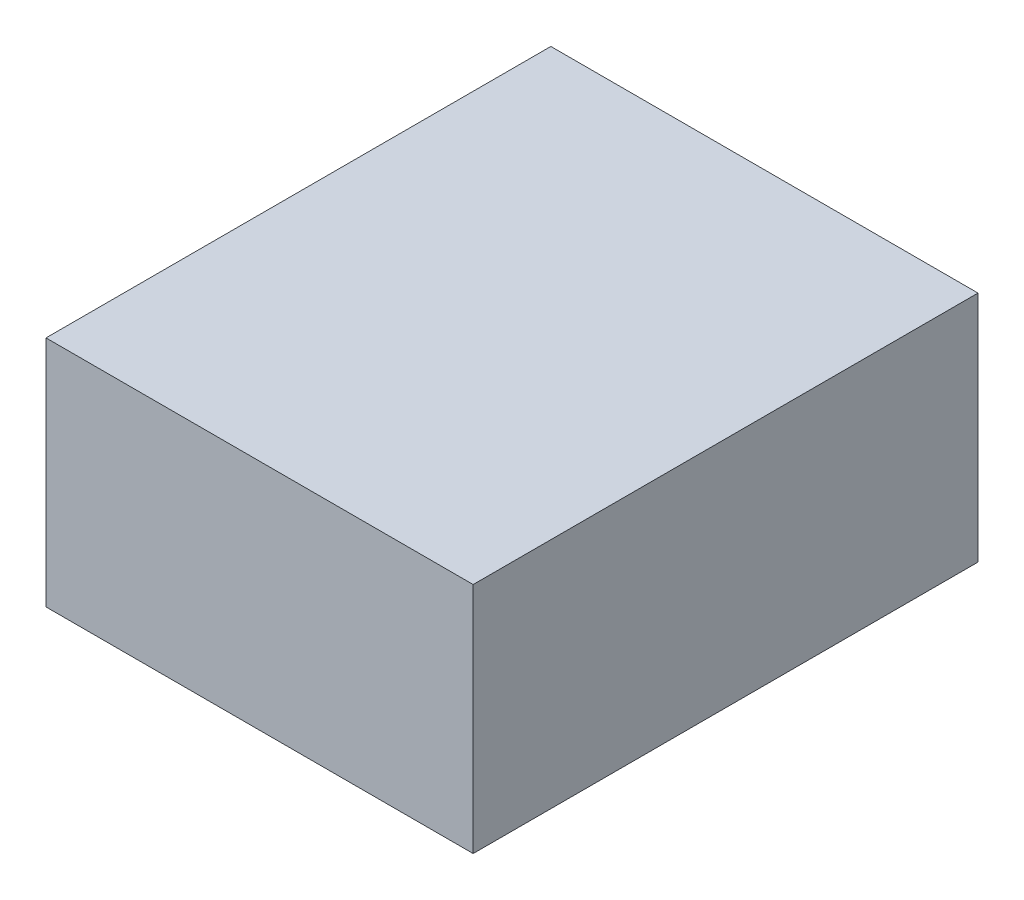
ISO-10303-21;
HEADER;
FILE_DESCRIPTION(('STEP AP214'),'2;1');
FILE_NAME('part.step','',(''),(''),'','','');
FILE_SCHEMA(('AUTOMOTIVE_DESIGN { 1 0 10303 214 1 1 1 1 }'));
ENDSEC;
DATA;
#1=APPLICATION_CONTEXT('core data for automotive mechanical design processes');
#2=APPLICATION_PROTOCOL_DEFINITION('international standard','automotive_design',2000,#1);
#3=PRODUCT_CONTEXT('',#1,'mechanical');
#4=PRODUCT('Part','Part','',(#3));
#5=PRODUCT_RELATED_PRODUCT_CATEGORY('part','',(#4));
#6=PRODUCT_DEFINITION_FORMATION('','',#4);
#7=PRODUCT_DEFINITION_CONTEXT('part definition',#1,'design');
#8=PRODUCT_DEFINITION('design','',#6,#7);
#9=PRODUCT_DEFINITION_SHAPE('','',#8);
#10=(LENGTH_UNIT() NAMED_UNIT(*) SI_UNIT(.MILLI.,.METRE.));
#11=(NAMED_UNIT(*) PLANE_ANGLE_UNIT() SI_UNIT($,.RADIAN.));
#12=(NAMED_UNIT(*) SI_UNIT($,.STERADIAN.) SOLID_ANGLE_UNIT());
#13=UNCERTAINTY_MEASURE_WITH_UNIT(LENGTH_MEASURE(1.E-05),#10,'distance_accuracy_value','');
#14=(GEOMETRIC_REPRESENTATION_CONTEXT(3) GLOBAL_UNCERTAINTY_ASSIGNED_CONTEXT((#13)) GLOBAL_UNIT_ASSIGNED_CONTEXT((#10,
#11,#12)) REPRESENTATION_CONTEXT('',''));
#15=CARTESIAN_POINT('',(0.,0.,0.));
#16=DIRECTION('',(0.,0.,1.));
#17=DIRECTION('',(1.,0.,0.));
#18=AXIS2_PLACEMENT_3D('',#15,#16,#17);
#19=CARTESIAN_POINT('',(0.5499989,0.2999994,0.));
#20=DIRECTION('',(0.,-1.,0.));
#21=DIRECTION('',(0.,0.,-1.));
#22=AXIS2_PLACEMENT_3D('',#19,#20,#21);
#23=PLANE('',#22);
#24=DIRECTION('',(0.,0.,-1.));
#25=VECTOR('',#24,1.);
#26=CARTESIAN_POINT('',(-0.5499989,0.2999994,0.));
#27=LINE('',#26,#25);
#28=CARTESIAN_POINT('',(-0.5499989,0.2999994,0.));
#29=VERTEX_POINT('',#28);
#30=CARTESIAN_POINT('',(-0.5499989,0.2999994,1.29999994));
#31=VERTEX_POINT('',#30);
#32=EDGE_CURVE('E20',#29,#31,#27,.F.);
#33=ORIENTED_EDGE('',*,*,#32,.T.);
#34=DIRECTION('',(-1.,0.,0.));
#35=VECTOR('',#34,1.);
#36=CARTESIAN_POINT('',(-0.5499989,0.2999994,1.29999994));
#37=LINE('',#36,#35);
#38=CARTESIAN_POINT('',(0.5499989,0.2999994,1.29999994));
#39=VERTEX_POINT('',#38);
#40=EDGE_CURVE('E55',#31,#39,#37,.F.);
#41=ORIENTED_EDGE('',*,*,#40,.T.);
#42=DIRECTION('',(0.,0.,1.));
#43=VECTOR('',#42,1.);
#44=CARTESIAN_POINT('',(0.5499989,0.2999994,0.));
#45=LINE('',#44,#43);
#46=CARTESIAN_POINT('',(0.5499989,0.2999994,0.));
#47=VERTEX_POINT('',#46);
#48=EDGE_CURVE('E76',#39,#47,#45,.F.);
#49=ORIENTED_EDGE('',*,*,#48,.T.);
#50=DIRECTION('',(-1.,0.,0.));
#51=VECTOR('',#50,1.);
#52=CARTESIAN_POINT('',(-0.5499989,0.2999994,0.));
#53=LINE('',#52,#51);
#54=EDGE_CURVE('E58',#29,#47,#53,.F.);
#55=ORIENTED_EDGE('',*,*,#54,.F.);
#56=EDGE_LOOP('',(#33,#41,#49,#55));
#57=FACE_BOUND('',#56,.T.);
#58=ADVANCED_FACE('F17',(#57),#23,.F.);
#59=CARTESIAN_POINT('',(-0.5499989,0.2999994,0.));
#60=DIRECTION('',(1.,0.,0.));
#61=DIRECTION('',(0.,0.,-1.));
#62=AXIS2_PLACEMENT_3D('',#59,#60,#61);
#63=PLANE('',#62);
#64=DIRECTION('',(0.,0.,1.));
#65=VECTOR('',#64,1.);
#66=CARTESIAN_POINT('',(-0.5499989,-0.2999994,0.));
#67=LINE('',#66,#65);
#68=CARTESIAN_POINT('',(-0.5499989,-0.2999994,0.));
#69=VERTEX_POINT('',#68);
#70=CARTESIAN_POINT('',(-0.5499989,-0.2999994,1.29999994));
#71=VERTEX_POINT('',#70);
#72=EDGE_CURVE('E73',#69,#71,#67,.T.);
#73=ORIENTED_EDGE('',*,*,#72,.T.);
#74=DIRECTION('',(0.,1.,0.));
#75=VECTOR('',#74,1.);
#76=CARTESIAN_POINT('',(-0.5499989,-0.2999994,1.29999994));
#77=LINE('',#76,#75);
#78=EDGE_CURVE('E63',#71,#31,#77,.T.);
#79=ORIENTED_EDGE('',*,*,#78,.T.);
#80=ORIENTED_EDGE('',*,*,#32,.F.);
#81=DIRECTION('',(0.,1.,0.));
#82=VECTOR('',#81,1.);
#83=CARTESIAN_POINT('',(-0.5499989,-0.2999994,0.));
#84=LINE('',#83,#82);
#85=EDGE_CURVE('E78',#69,#29,#84,.T.);
#86=ORIENTED_EDGE('',*,*,#85,.F.);
#87=EDGE_LOOP('',(#73,#79,#80,#86));
#88=FACE_BOUND('',#87,.T.);
#89=ADVANCED_FACE('F72',(#88),#63,.F.);
#90=CARTESIAN_POINT('',(-0.5499989,-0.2999994,1.29999994));
#91=DIRECTION('',(0.,0.,-1.));
#92=DIRECTION('',(-1.,0.,0.));
#93=AXIS2_PLACEMENT_3D('',#90,#91,#92);
#94=PLANE('',#93);
#95=DIRECTION('',(0.,1.,0.));
#96=VECTOR('',#95,1.);
#97=CARTESIAN_POINT('',(0.5499989,-0.2999994,1.29999994));
#98=LINE('',#97,#96);
#99=CARTESIAN_POINT('',(0.5499989,-0.2999994,1.29999994));
#100=VERTEX_POINT('',#99);
#101=EDGE_CURVE('E69',#100,#39,#98,.T.);
#102=ORIENTED_EDGE('',*,*,#101,.T.);
#103=ORIENTED_EDGE('',*,*,#40,.F.);
#104=ORIENTED_EDGE('',*,*,#78,.F.);
#105=DIRECTION('',(1.,0.,0.));
#106=VECTOR('',#105,1.);
#107=CARTESIAN_POINT('',(-0.5499989,-0.2999994,1.29999994));
#108=LINE('',#107,#106);
#109=EDGE_CURVE('E83',#71,#100,#108,.T.);
#110=ORIENTED_EDGE('',*,*,#109,.T.);
#111=EDGE_LOOP('',(#102,#103,#104,#110));
#112=FACE_BOUND('',#111,.T.);
#113=ADVANCED_FACE('F66',(#112),#94,.F.);
#114=CARTESIAN_POINT('',(0.5499989,-0.2999994,0.));
#115=DIRECTION('',(-1.,0.,0.));
#116=DIRECTION('',(0.,0.,1.));
#117=AXIS2_PLACEMENT_3D('',#114,#115,#116);
#118=PLANE('',#117);
#119=ORIENTED_EDGE('',*,*,#48,.F.);
#120=ORIENTED_EDGE('',*,*,#101,.F.);
#121=DIRECTION('',(0.,0.,1.));
#122=VECTOR('',#121,1.);
#123=CARTESIAN_POINT('',(0.5499989,-0.2999994,0.));
#124=LINE('',#123,#122);
#125=CARTESIAN_POINT('',(0.5499989,-0.2999994,0.));
#126=VERTEX_POINT('',#125);
#127=EDGE_CURVE('E26',#100,#126,#124,.F.);
#128=ORIENTED_EDGE('',*,*,#127,.T.);
#129=DIRECTION('',(0.,1.,0.));
#130=VECTOR('',#129,1.);
#131=CARTESIAN_POINT('',(0.5499989,-0.2999994,0.));
#132=LINE('',#131,#130);
#133=EDGE_CURVE('E34',#47,#126,#132,.F.);
#134=ORIENTED_EDGE('',*,*,#133,.F.);
#135=EDGE_LOOP('',(#119,#120,#128,#134));
#136=FACE_BOUND('',#135,.T.);
#137=ADVANCED_FACE('F88',(#136),#118,.F.);
#138=CARTESIAN_POINT('',(-0.5499989,-0.2999994,0.));
#139=DIRECTION('',(0.,0.,-1.));
#140=DIRECTION('',(-1.,0.,0.));
#141=AXIS2_PLACEMENT_3D('',#138,#139,#140);
#142=PLANE('',#141);
#143=ORIENTED_EDGE('',*,*,#133,.T.);
#144=DIRECTION('',(1.,0.,0.));
#145=VECTOR('',#144,1.);
#146=CARTESIAN_POINT('',(-0.5499989,-0.2999994,0.));
#147=LINE('',#146,#145);
#148=EDGE_CURVE('E11',#126,#69,#147,.F.);
#149=ORIENTED_EDGE('',*,*,#148,.T.);
#150=ORIENTED_EDGE('',*,*,#85,.T.);
#151=ORIENTED_EDGE('',*,*,#54,.T.);
#152=EDGE_LOOP('',(#143,#149,#150,#151));
#153=FACE_BOUND('',#152,.T.);
#154=ADVANCED_FACE('F91',(#153),#142,.T.);
#155=CARTESIAN_POINT('',(-0.5499989,-0.2999994,0.));
#156=DIRECTION('',(0.,1.,0.));
#157=DIRECTION('',(0.,0.,1.));
#158=AXIS2_PLACEMENT_3D('',#155,#156,#157);
#159=PLANE('',#158);
#160=ORIENTED_EDGE('',*,*,#127,.F.);
#161=ORIENTED_EDGE('',*,*,#109,.F.);
#162=ORIENTED_EDGE('',*,*,#72,.F.);
#163=ORIENTED_EDGE('',*,*,#148,.F.);
#164=EDGE_LOOP('',(#160,#161,#162,#163));
#165=FACE_BOUND('',#164,.T.);
#166=ADVANCED_FACE('F90',(#165),#159,.F.);
#167=CLOSED_SHELL('',(#58,#89,#113,#137,#154,#166));
#168=MANIFOLD_SOLID_BREP('B1',#167);
#169=ADVANCED_BREP_SHAPE_REPRESENTATION('',(#18,#168),#14);
#170=SHAPE_DEFINITION_REPRESENTATION(#9,#169);
ENDSEC;
END-ISO-10303-21;
